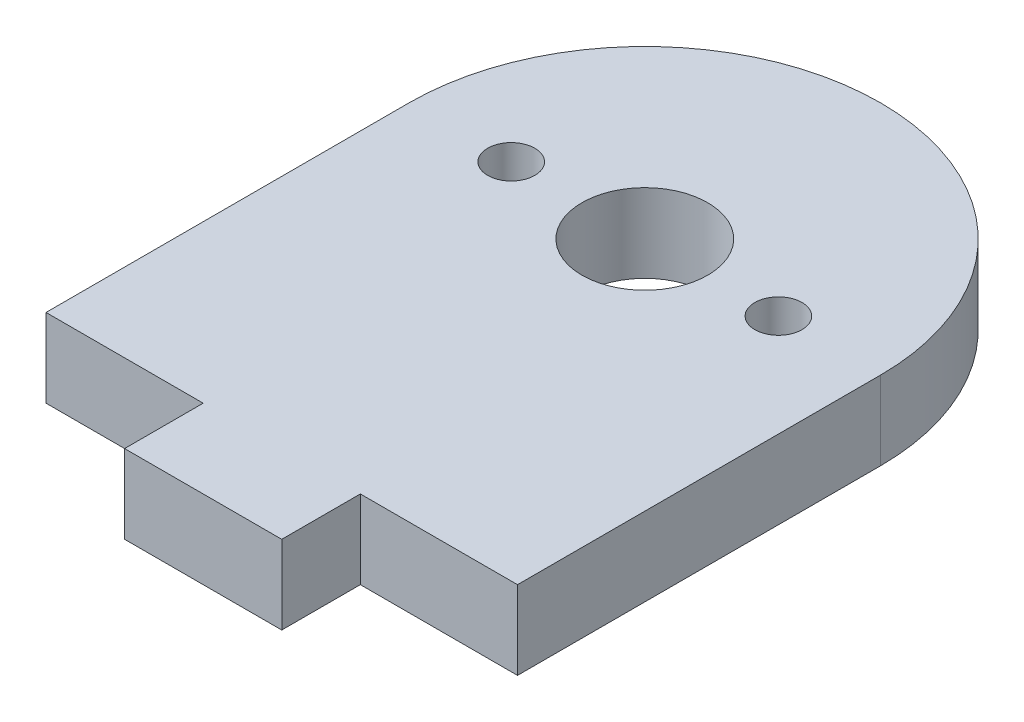
ISO-10303-21;
HEADER;
FILE_DESCRIPTION(('STEP AP214'),'2;1');
FILE_NAME('part.step','',(''),(''),'','','');
FILE_SCHEMA(('AUTOMOTIVE_DESIGN { 1 0 10303 214 1 1 1 1 }'));
ENDSEC;
DATA;
#1=APPLICATION_CONTEXT('core data for automotive mechanical design processes');
#2=APPLICATION_PROTOCOL_DEFINITION('international standard','automotive_design',2000,#1);
#3=PRODUCT_CONTEXT('',#1,'mechanical');
#4=PRODUCT('Part','Part','',(#3));
#5=PRODUCT_RELATED_PRODUCT_CATEGORY('part','',(#4));
#6=PRODUCT_DEFINITION_FORMATION('','',#4);
#7=PRODUCT_DEFINITION_CONTEXT('part definition',#1,'design');
#8=PRODUCT_DEFINITION('design','',#6,#7);
#9=PRODUCT_DEFINITION_SHAPE('','',#8);
#10=(LENGTH_UNIT() NAMED_UNIT(*) SI_UNIT(.MILLI.,.METRE.));
#11=(NAMED_UNIT(*) PLANE_ANGLE_UNIT() SI_UNIT($,.RADIAN.));
#12=(NAMED_UNIT(*) SI_UNIT($,.STERADIAN.) SOLID_ANGLE_UNIT());
#13=UNCERTAINTY_MEASURE_WITH_UNIT(LENGTH_MEASURE(1.E-05),#10,'distance_accuracy_value','');
#14=(GEOMETRIC_REPRESENTATION_CONTEXT(3) GLOBAL_UNCERTAINTY_ASSIGNED_CONTEXT((#13)) GLOBAL_UNIT_ASSIGNED_CONTEXT((#10,
#11,#12)) REPRESENTATION_CONTEXT('',''));
#15=CARTESIAN_POINT('',(0.,0.,0.));
#16=DIRECTION('',(0.,0.,1.));
#17=DIRECTION('',(1.,0.,0.));
#18=AXIS2_PLACEMENT_3D('',#15,#16,#17);
#19=CARTESIAN_POINT('',(0.,5.,11.55));
#20=DIRECTION('',(0.,0.,-1.));
#21=DIRECTION('',(-1.,0.,0.));
#22=AXIS2_PLACEMENT_3D('',#19,#20,#21);
#23=PLANE('',#22);
#24=DIRECTION('',(0.,1.,0.));
#25=VECTOR('',#24,1.);
#26=CARTESIAN_POINT('',(5.,0.,11.55));
#27=LINE('',#26,#25);
#28=CARTESIAN_POINT('',(5.,0.,11.55));
#29=VERTEX_POINT('',#28);
#30=CARTESIAN_POINT('',(5.,5.,11.55));
#31=VERTEX_POINT('',#30);
#32=EDGE_CURVE('E142',#29,#31,#27,.T.);
#33=ORIENTED_EDGE('',*,*,#32,.F.);
#34=DIRECTION('',(1.,0.,0.));
#35=VECTOR('',#34,1.);
#36=CARTESIAN_POINT('',(0.,0.,11.55));
#37=LINE('',#36,#35);
#38=CARTESIAN_POINT('',(15.,0.,11.55));
#39=VERTEX_POINT('',#38);
#40=EDGE_CURVE('E178',#29,#39,#37,.T.);
#41=ORIENTED_EDGE('',*,*,#40,.T.);
#42=DIRECTION('',(0.,-1.,0.));
#43=VECTOR('',#42,1.);
#44=CARTESIAN_POINT('',(15.,5.,11.55));
#45=LINE('',#44,#43);
#46=CARTESIAN_POINT('',(15.,5.,11.55));
#47=VERTEX_POINT('',#46);
#48=EDGE_CURVE('E183',#47,#39,#45,.T.);
#49=ORIENTED_EDGE('',*,*,#48,.F.);
#50=DIRECTION('',(1.,0.,0.));
#51=VECTOR('',#50,1.);
#52=CARTESIAN_POINT('',(0.,5.,11.55));
#53=LINE('',#52,#51);
#54=EDGE_CURVE('E167',#31,#47,#53,.T.);
#55=ORIENTED_EDGE('',*,*,#54,.F.);
#56=EDGE_LOOP('',(#33,#41,#49,#55));
#57=FACE_BOUND('',#56,.T.);
#58=ADVANCED_FACE('F36',(#57),#23,.F.);
#59=CARTESIAN_POINT('',(0.,5.,-11.55));
#60=DIRECTION('',(0.,-1.,0.));
#61=DIRECTION('',(0.,0.,-1.));
#62=AXIS2_PLACEMENT_3D('',#59,#60,#61);
#63=CYLINDRICAL_SURFACE('',#62,15.);
#64=CARTESIAN_POINT('',(0.,0.,-11.55));
#65=DIRECTION('',(0.,1.,0.));
#66=DIRECTION('',(0.,0.,1.));
#67=AXIS2_PLACEMENT_3D('',#64,#65,#66);
#68=CIRCLE('',#67,15.);
#69=CARTESIAN_POINT('',(15.,0.,-11.55));
#70=VERTEX_POINT('',#69);
#71=CARTESIAN_POINT('',(-15.,0.,-11.55));
#72=VERTEX_POINT('',#71);
#73=EDGE_CURVE('E160',#70,#72,#68,.T.);
#74=ORIENTED_EDGE('',*,*,#73,.T.);
#75=DIRECTION('',(0.,-1.,0.));
#76=VECTOR('',#75,1.);
#77=CARTESIAN_POINT('',(-15.,5.,-11.55));
#78=LINE('',#77,#76);
#79=CARTESIAN_POINT('',(-15.,5.,-11.55));
#80=VERTEX_POINT('',#79);
#81=EDGE_CURVE('E11',#80,#72,#78,.T.);
#82=ORIENTED_EDGE('',*,*,#81,.F.);
#83=CARTESIAN_POINT('',(0.,5.,-11.55));
#84=DIRECTION('',(0.,1.,0.));
#85=DIRECTION('',(0.,0.,1.));
#86=AXIS2_PLACEMENT_3D('',#83,#84,#85);
#87=CIRCLE('',#86,15.);
#88=CARTESIAN_POINT('',(15.,5.,-11.55));
#89=VERTEX_POINT('',#88);
#90=EDGE_CURVE('E85',#89,#80,#87,.T.);
#91=ORIENTED_EDGE('',*,*,#90,.F.);
#92=DIRECTION('',(0.,-1.,0.));
#93=VECTOR('',#92,1.);
#94=CARTESIAN_POINT('',(15.,5.,-11.55));
#95=LINE('',#94,#93);
#96=EDGE_CURVE('E172',#89,#70,#95,.T.);
#97=ORIENTED_EDGE('',*,*,#96,.T.);
#98=EDGE_LOOP('',(#74,#82,#91,#97));
#99=FACE_BOUND('',#98,.T.);
#100=ADVANCED_FACE('F38',(#99),#63,.T.);
#101=CARTESIAN_POINT('',(-15.,5.,0.));
#102=DIRECTION('',(-1.,0.,0.));
#103=DIRECTION('',(0.,0.,1.));
#104=AXIS2_PLACEMENT_3D('',#101,#102,#103);
#105=PLANE('',#104);
#106=DIRECTION('',(0.,0.,-1.));
#107=VECTOR('',#106,1.);
#108=CARTESIAN_POINT('',(-15.,0.,0.));
#109=LINE('',#108,#107);
#110=CARTESIAN_POINT('',(-15.,0.,11.55));
#111=VERTEX_POINT('',#110);
#112=EDGE_CURVE('E175',#111,#72,#109,.T.);
#113=ORIENTED_EDGE('',*,*,#112,.F.);
#114=DIRECTION('',(0.,-1.,0.));
#115=VECTOR('',#114,1.);
#116=CARTESIAN_POINT('',(-15.,5.,11.55));
#117=LINE('',#116,#115);
#118=CARTESIAN_POINT('',(-15.,5.,11.55));
#119=VERTEX_POINT('',#118);
#120=EDGE_CURVE('E44',#119,#111,#117,.T.);
#121=ORIENTED_EDGE('',*,*,#120,.F.);
#122=DIRECTION('',(0.,0.,-1.));
#123=VECTOR('',#122,1.);
#124=CARTESIAN_POINT('',(-15.,5.,0.));
#125=LINE('',#124,#123);
#126=EDGE_CURVE('E164',#119,#80,#125,.T.);
#127=ORIENTED_EDGE('',*,*,#126,.T.);
#128=ORIENTED_EDGE('',*,*,#81,.T.);
#129=EDGE_LOOP('',(#113,#121,#127,#128));
#130=FACE_BOUND('',#129,.T.);
#131=ADVANCED_FACE('F189',(#130),#105,.T.);
#132=CARTESIAN_POINT('',(-5.,0.,11.55));
#133=VERTEX_POINT('',#132);
#134=EDGE_CURVE('E179',#111,#133,#37,.T.);
#135=ORIENTED_EDGE('',*,*,#134,.T.);
#136=DIRECTION('',(0.,1.,0.));
#137=VECTOR('',#136,1.);
#138=CARTESIAN_POINT('',(-5.,0.,11.55));
#139=LINE('',#138,#137);
#140=CARTESIAN_POINT('',(-5.,5.,11.55));
#141=VERTEX_POINT('',#140);
#142=EDGE_CURVE('E131',#133,#141,#139,.T.);
#143=ORIENTED_EDGE('',*,*,#142,.T.);
#144=EDGE_CURVE('E168',#119,#141,#53,.T.);
#145=ORIENTED_EDGE('',*,*,#144,.F.);
#146=ORIENTED_EDGE('',*,*,#120,.T.);
#147=EDGE_LOOP('',(#135,#143,#145,#146));
#148=FACE_BOUND('',#147,.T.);
#149=ADVANCED_FACE('F186',(#148),#23,.F.);
#150=CARTESIAN_POINT('',(15.,5.,0.));
#151=DIRECTION('',(-1.,0.,0.));
#152=DIRECTION('',(0.,0.,1.));
#153=AXIS2_PLACEMENT_3D('',#150,#151,#152);
#154=PLANE('',#153);
#155=DIRECTION('',(0.,0.,-1.));
#156=VECTOR('',#155,1.);
#157=CARTESIAN_POINT('',(15.,0.,0.));
#158=LINE('',#157,#156);
#159=EDGE_CURVE('E80',#39,#70,#158,.T.);
#160=ORIENTED_EDGE('',*,*,#159,.T.);
#161=ORIENTED_EDGE('',*,*,#96,.F.);
#162=DIRECTION('',(0.,0.,-1.));
#163=VECTOR('',#162,1.);
#164=CARTESIAN_POINT('',(15.,5.,0.));
#165=LINE('',#164,#163);
#166=EDGE_CURVE('E60',#47,#89,#165,.T.);
#167=ORIENTED_EDGE('',*,*,#166,.F.);
#168=ORIENTED_EDGE('',*,*,#48,.T.);
#169=EDGE_LOOP('',(#160,#161,#167,#168));
#170=FACE_BOUND('',#169,.T.);
#171=ADVANCED_FACE('F195',(#170),#154,.F.);
#172=CARTESIAN_POINT('',(0.,5.,0.));
#173=DIRECTION('',(0.,1.,0.));
#174=DIRECTION('',(0.,0.,1.));
#175=AXIS2_PLACEMENT_3D('',#172,#173,#174);
#176=PLANE('',#175);
#177=ORIENTED_EDGE('',*,*,#90,.T.);
#178=ORIENTED_EDGE('',*,*,#126,.F.);
#179=ORIENTED_EDGE('',*,*,#144,.T.);
#180=DIRECTION('',(0.,0.,1.));
#181=VECTOR('',#180,1.);
#182=CARTESIAN_POINT('',(-5.,5.,11.55));
#183=LINE('',#182,#181);
#184=CARTESIAN_POINT('',(-5.,5.,16.55));
#185=VERTEX_POINT('',#184);
#186=EDGE_CURVE('E51',#141,#185,#183,.T.);
#187=ORIENTED_EDGE('',*,*,#186,.T.);
#188=DIRECTION('',(1.,0.,0.));
#189=VECTOR('',#188,1.);
#190=CARTESIAN_POINT('',(-5.,5.,16.55));
#191=LINE('',#190,#189);
#192=CARTESIAN_POINT('',(5.,5.,16.55));
#193=VERTEX_POINT('',#192);
#194=EDGE_CURVE('E114',#185,#193,#191,.T.);
#195=ORIENTED_EDGE('',*,*,#194,.T.);
#196=DIRECTION('',(0.,0.,-1.));
#197=VECTOR('',#196,1.);
#198=CARTESIAN_POINT('',(5.,5.,11.55));
#199=LINE('',#198,#197);
#200=EDGE_CURVE('E132',#193,#31,#199,.T.);
#201=ORIENTED_EDGE('',*,*,#200,.T.);
#202=ORIENTED_EDGE('',*,*,#54,.T.);
#203=ORIENTED_EDGE('',*,*,#166,.T.);
#204=EDGE_LOOP('',(#177,#178,#179,#187,#195,#201,#202,#203));
#205=FACE_BOUND('',#204,.T.);
#206=CARTESIAN_POINT('',(0.,5.,-11.55));
#207=DIRECTION('',(0.,1.,0.));
#208=DIRECTION('',(0.,0.,1.));
#209=AXIS2_PLACEMENT_3D('',#206,#207,#208);
#210=CIRCLE('',#209,4.);
#211=CARTESIAN_POINT('',(0.,5.,-7.55));
#212=VERTEX_POINT('',#211);
#213=EDGE_CURVE('E141',#212,#212,#210,.T.);
#214=ORIENTED_EDGE('',*,*,#213,.F.);
#215=EDGE_LOOP('',(#214));
#216=FACE_BOUND('',#215,.T.);
#217=CARTESIAN_POINT('',(8.5,5.,-11.55));
#218=DIRECTION('',(0.,1.,0.));
#219=DIRECTION('',(0.,0.,1.));
#220=AXIS2_PLACEMENT_3D('',#217,#218,#219);
#221=CIRCLE('',#220,1.5);
#222=CARTESIAN_POINT('',(8.5,5.,-10.05));
#223=VERTEX_POINT('',#222);
#224=EDGE_CURVE('E148',#223,#223,#221,.T.);
#225=ORIENTED_EDGE('',*,*,#224,.F.);
#226=EDGE_LOOP('',(#225));
#227=FACE_BOUND('',#226,.T.);
#228=CARTESIAN_POINT('',(-8.5,5.,-11.55));
#229=DIRECTION('',(0.,1.,0.));
#230=DIRECTION('',(0.,0.,1.));
#231=AXIS2_PLACEMENT_3D('',#228,#229,#230);
#232=CIRCLE('',#231,1.5);
#233=CARTESIAN_POINT('',(-8.5,5.,-10.05));
#234=VERTEX_POINT('',#233);
#235=EDGE_CURVE('E154',#234,#234,#232,.T.);
#236=ORIENTED_EDGE('',*,*,#235,.F.);
#237=EDGE_LOOP('',(#236));
#238=FACE_BOUND('',#237,.T.);
#239=ADVANCED_FACE('F197',(#205,#216,#227,#238),#176,.T.);
#240=CARTESIAN_POINT('',(0.,0.,0.));
#241=DIRECTION('',(0.,1.,0.));
#242=DIRECTION('',(0.,0.,1.));
#243=AXIS2_PLACEMENT_3D('',#240,#241,#242);
#244=PLANE('',#243);
#245=ORIENTED_EDGE('',*,*,#73,.F.);
#246=ORIENTED_EDGE('',*,*,#159,.F.);
#247=ORIENTED_EDGE('',*,*,#40,.F.);
#248=DIRECTION('',(0.,0.,-1.));
#249=VECTOR('',#248,1.);
#250=CARTESIAN_POINT('',(5.,0.,11.55));
#251=LINE('',#250,#249);
#252=CARTESIAN_POINT('',(5.,0.,16.55));
#253=VERTEX_POINT('',#252);
#254=EDGE_CURVE('E117',#253,#29,#251,.T.);
#255=ORIENTED_EDGE('',*,*,#254,.F.);
#256=DIRECTION('',(1.,0.,0.));
#257=VECTOR('',#256,1.);
#258=CARTESIAN_POINT('',(-5.,0.,16.55));
#259=LINE('',#258,#257);
#260=CARTESIAN_POINT('',(-5.,0.,16.55));
#261=VERTEX_POINT('',#260);
#262=EDGE_CURVE('E112',#261,#253,#259,.T.);
#263=ORIENTED_EDGE('',*,*,#262,.F.);
#264=DIRECTION('',(0.,0.,1.));
#265=VECTOR('',#264,1.);
#266=CARTESIAN_POINT('',(-5.,0.,11.55));
#267=LINE('',#266,#265);
#268=EDGE_CURVE('E126',#133,#261,#267,.T.);
#269=ORIENTED_EDGE('',*,*,#268,.F.);
#270=ORIENTED_EDGE('',*,*,#134,.F.);
#271=ORIENTED_EDGE('',*,*,#112,.T.);
#272=EDGE_LOOP('',(#245,#246,#247,#255,#263,#269,#270,#271));
#273=FACE_BOUND('',#272,.T.);
#274=CARTESIAN_POINT('',(0.,0.,-11.55));
#275=DIRECTION('',(0.,1.,0.));
#276=DIRECTION('',(0.,0.,1.));
#277=AXIS2_PLACEMENT_3D('',#274,#275,#276);
#278=CIRCLE('',#277,4.);
#279=CARTESIAN_POINT('',(0.,0.,-7.55));
#280=VERTEX_POINT('',#279);
#281=EDGE_CURVE('E145',#280,#280,#278,.T.);
#282=ORIENTED_EDGE('',*,*,#281,.T.);
#283=EDGE_LOOP('',(#282));
#284=FACE_BOUND('',#283,.T.);
#285=CARTESIAN_POINT('',(8.5,0.,-11.55));
#286=DIRECTION('',(0.,1.,0.));
#287=DIRECTION('',(0.,0.,1.));
#288=AXIS2_PLACEMENT_3D('',#285,#286,#287);
#289=CIRCLE('',#288,1.5);
#290=CARTESIAN_POINT('',(8.5,0.,-10.05));
#291=VERTEX_POINT('',#290);
#292=EDGE_CURVE('E151',#291,#291,#289,.T.);
#293=ORIENTED_EDGE('',*,*,#292,.T.);
#294=EDGE_LOOP('',(#293));
#295=FACE_BOUND('',#294,.T.);
#296=CARTESIAN_POINT('',(-8.5,0.,-11.55));
#297=DIRECTION('',(0.,1.,0.));
#298=DIRECTION('',(0.,0.,1.));
#299=AXIS2_PLACEMENT_3D('',#296,#297,#298);
#300=CIRCLE('',#299,1.5);
#301=CARTESIAN_POINT('',(-8.5,0.,-10.05));
#302=VERTEX_POINT('',#301);
#303=EDGE_CURVE('E157',#302,#302,#300,.T.);
#304=ORIENTED_EDGE('',*,*,#303,.T.);
#305=EDGE_LOOP('',(#304));
#306=FACE_BOUND('',#305,.T.);
#307=ADVANCED_FACE('F123',(#273,#284,#295,#306),#244,.F.);
#308=CARTESIAN_POINT('',(-8.5,0.,-11.55));
#309=DIRECTION('',(0.,1.,0.));
#310=DIRECTION('',(0.,0.,1.));
#311=AXIS2_PLACEMENT_3D('',#308,#309,#310);
#312=CYLINDRICAL_SURFACE('',#311,1.5);
#313=ORIENTED_EDGE('',*,*,#303,.F.);
#314=EDGE_LOOP('',(#313));
#315=FACE_BOUND('',#314,.T.);
#316=ORIENTED_EDGE('',*,*,#235,.T.);
#317=EDGE_LOOP('',(#316));
#318=FACE_BOUND('',#317,.T.);
#319=ADVANCED_FACE('F239',(#315,#318),#312,.F.);
#320=CARTESIAN_POINT('',(8.5,0.,-11.55));
#321=DIRECTION('',(0.,1.,0.));
#322=DIRECTION('',(0.,0.,1.));
#323=AXIS2_PLACEMENT_3D('',#320,#321,#322);
#324=CYLINDRICAL_SURFACE('',#323,1.5);
#325=ORIENTED_EDGE('',*,*,#292,.F.);
#326=EDGE_LOOP('',(#325));
#327=FACE_BOUND('',#326,.T.);
#328=ORIENTED_EDGE('',*,*,#224,.T.);
#329=EDGE_LOOP('',(#328));
#330=FACE_BOUND('',#329,.T.);
#331=ADVANCED_FACE('F274',(#327,#330),#324,.F.);
#332=CARTESIAN_POINT('',(0.,0.,-11.55));
#333=DIRECTION('',(0.,1.,0.));
#334=DIRECTION('',(0.,0.,1.));
#335=AXIS2_PLACEMENT_3D('',#332,#333,#334);
#336=CYLINDRICAL_SURFACE('',#335,4.);
#337=ORIENTED_EDGE('',*,*,#281,.F.);
#338=EDGE_LOOP('',(#337));
#339=FACE_BOUND('',#338,.T.);
#340=ORIENTED_EDGE('',*,*,#213,.T.);
#341=EDGE_LOOP('',(#340));
#342=FACE_BOUND('',#341,.T.);
#343=ADVANCED_FACE('F250',(#339,#342),#336,.F.);
#344=CARTESIAN_POINT('',(-5.,0.,11.55));
#345=DIRECTION('',(-1.,0.,0.));
#346=DIRECTION('',(0.,0.,1.));
#347=AXIS2_PLACEMENT_3D('',#344,#345,#346);
#348=PLANE('',#347);
#349=ORIENTED_EDGE('',*,*,#186,.F.);
#350=ORIENTED_EDGE('',*,*,#142,.F.);
#351=ORIENTED_EDGE('',*,*,#268,.T.);
#352=DIRECTION('',(0.,1.,0.));
#353=VECTOR('',#352,1.);
#354=CARTESIAN_POINT('',(-5.,0.,16.55));
#355=LINE('',#354,#353);
#356=EDGE_CURVE('E109',#261,#185,#355,.T.);
#357=ORIENTED_EDGE('',*,*,#356,.T.);
#358=EDGE_LOOP('',(#349,#350,#351,#357));
#359=FACE_BOUND('',#358,.T.);
#360=ADVANCED_FACE('F130',(#359),#348,.T.);
#361=CARTESIAN_POINT('',(5.,0.,11.55));
#362=DIRECTION('',(1.,0.,0.));
#363=DIRECTION('',(0.,0.,-1.));
#364=AXIS2_PLACEMENT_3D('',#361,#362,#363);
#365=PLANE('',#364);
#366=ORIENTED_EDGE('',*,*,#200,.F.);
#367=DIRECTION('',(0.,1.,0.));
#368=VECTOR('',#367,1.);
#369=CARTESIAN_POINT('',(5.,0.,16.55));
#370=LINE('',#369,#368);
#371=EDGE_CURVE('E116',#253,#193,#370,.T.);
#372=ORIENTED_EDGE('',*,*,#371,.F.);
#373=ORIENTED_EDGE('',*,*,#254,.T.);
#374=ORIENTED_EDGE('',*,*,#32,.T.);
#375=EDGE_LOOP('',(#366,#372,#373,#374));
#376=FACE_BOUND('',#375,.T.);
#377=ADVANCED_FACE('F249',(#376),#365,.T.);
#378=CARTESIAN_POINT('',(-5.,0.,16.55));
#379=DIRECTION('',(0.,0.,1.));
#380=DIRECTION('',(1.,0.,0.));
#381=AXIS2_PLACEMENT_3D('',#378,#379,#380);
#382=PLANE('',#381);
#383=ORIENTED_EDGE('',*,*,#194,.F.);
#384=ORIENTED_EDGE('',*,*,#356,.F.);
#385=ORIENTED_EDGE('',*,*,#262,.T.);
#386=ORIENTED_EDGE('',*,*,#371,.T.);
#387=EDGE_LOOP('',(#383,#384,#385,#386));
#388=FACE_BOUND('',#387,.T.);
#389=ADVANCED_FACE('F111',(#388),#382,.T.);
#390=CLOSED_SHELL('',(#58,#100,#131,#149,#171,#239,#307,#319,#331,#343,#360,#377,#389));
#391=MANIFOLD_SOLID_BREP('B2',#390);
#392=ADVANCED_BREP_SHAPE_REPRESENTATION('',(#18,#391),#14);
#393=SHAPE_DEFINITION_REPRESENTATION(#9,#392);
ENDSEC;
END-ISO-10303-21;
